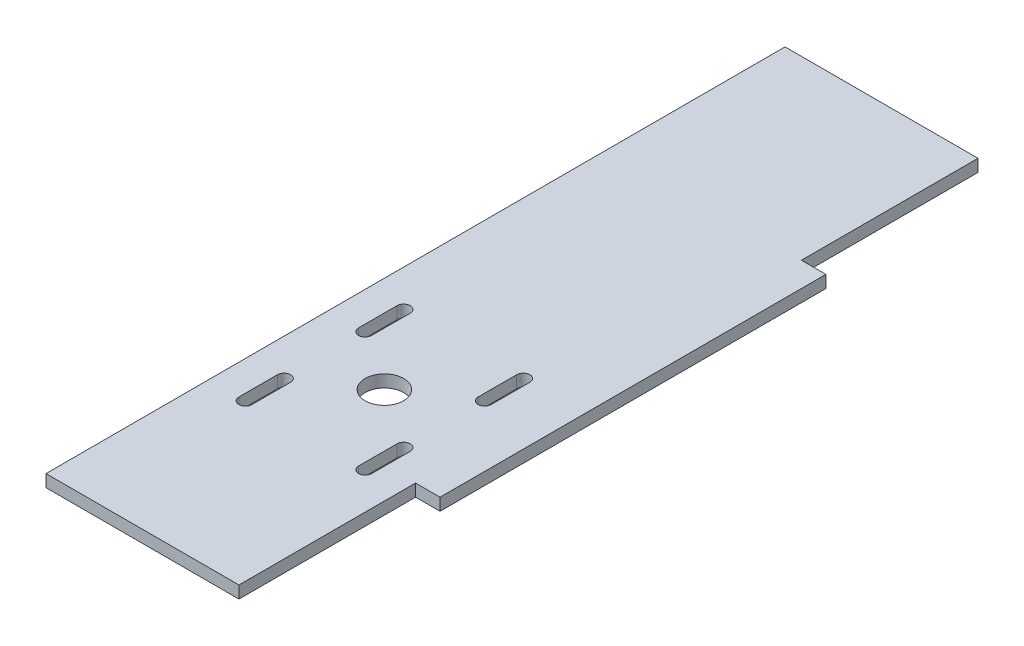
ISO-10303-21;
HEADER;
FILE_DESCRIPTION(('STEP AP214'),'2;1');
FILE_NAME('part.step','',(''),(''),'','','');
FILE_SCHEMA(('AUTOMOTIVE_DESIGN { 1 0 10303 214 1 1 1 1 }'));
ENDSEC;
DATA;
#1=APPLICATION_CONTEXT('core data for automotive mechanical design processes');
#2=APPLICATION_PROTOCOL_DEFINITION('international standard','automotive_design',2000,#1);
#3=PRODUCT_CONTEXT('',#1,'mechanical');
#4=PRODUCT('Part','Part','',(#3));
#5=PRODUCT_RELATED_PRODUCT_CATEGORY('part','',(#4));
#6=PRODUCT_DEFINITION_FORMATION('','',#4);
#7=PRODUCT_DEFINITION_CONTEXT('part definition',#1,'design');
#8=PRODUCT_DEFINITION('design','',#6,#7);
#9=PRODUCT_DEFINITION_SHAPE('','',#8);
#10=(LENGTH_UNIT() NAMED_UNIT(*) SI_UNIT(.MILLI.,.METRE.));
#11=(NAMED_UNIT(*) PLANE_ANGLE_UNIT() SI_UNIT($,.RADIAN.));
#12=(NAMED_UNIT(*) SI_UNIT($,.STERADIAN.) SOLID_ANGLE_UNIT());
#13=UNCERTAINTY_MEASURE_WITH_UNIT(LENGTH_MEASURE(1.E-05),#10,'distance_accuracy_value','');
#14=(GEOMETRIC_REPRESENTATION_CONTEXT(3) GLOBAL_UNCERTAINTY_ASSIGNED_CONTEXT((#13)) GLOBAL_UNIT_ASSIGNED_CONTEXT((#10,
#11,#12)) REPRESENTATION_CONTEXT('',''));
#15=CARTESIAN_POINT('',(0.,0.,0.));
#16=DIRECTION('',(0.,0.,1.));
#17=DIRECTION('',(1.,0.,0.));
#18=AXIS2_PLACEMENT_3D('',#15,#16,#17);
#19=CARTESIAN_POINT('',(-25.,3.175,0.));
#20=DIRECTION('',(-1.,0.,0.));
#21=DIRECTION('',(0.,0.,1.));
#22=AXIS2_PLACEMENT_3D('',#19,#20,#21);
#23=PLANE('',#22);
#24=DIRECTION('',(0.,0.,-1.));
#25=VECTOR('',#24,1.);
#26=CARTESIAN_POINT('',(-25.,0.,0.));
#27=LINE('',#26,#25);
#28=CARTESIAN_POINT('',(-25.,0.,145.75));
#29=VERTEX_POINT('',#28);
#30=CARTESIAN_POINT('',(-25.,0.,-45.75));
#31=VERTEX_POINT('',#30);
#32=EDGE_CURVE('E328',#29,#31,#27,.T.);
#33=ORIENTED_EDGE('',*,*,#32,.F.);
#34=DIRECTION('',(0.,-1.,0.));
#35=VECTOR('',#34,1.);
#36=CARTESIAN_POINT('',(-25.,3.175,145.75));
#37=LINE('',#36,#35);
#38=CARTESIAN_POINT('',(-25.,3.175,145.75));
#39=VERTEX_POINT('',#38);
#40=EDGE_CURVE('E11',#39,#29,#37,.T.);
#41=ORIENTED_EDGE('',*,*,#40,.F.);
#42=DIRECTION('',(0.,0.,-1.));
#43=VECTOR('',#42,1.);
#44=CARTESIAN_POINT('',(-25.,3.175,0.));
#45=LINE('',#44,#43);
#46=CARTESIAN_POINT('',(-25.,3.175,-45.75));
#47=VERTEX_POINT('',#46);
#48=EDGE_CURVE('E331',#39,#47,#45,.T.);
#49=ORIENTED_EDGE('',*,*,#48,.T.);
#50=DIRECTION('',(0.,-1.,0.));
#51=VECTOR('',#50,1.);
#52=CARTESIAN_POINT('',(-25.,3.175,-45.75));
#53=LINE('',#52,#51);
#54=EDGE_CURVE('E356',#47,#31,#53,.T.);
#55=ORIENTED_EDGE('',*,*,#54,.T.);
#56=EDGE_LOOP('',(#33,#41,#49,#55));
#57=FACE_BOUND('',#56,.T.);
#58=ADVANCED_FACE('F34',(#57),#23,.T.);
#59=CARTESIAN_POINT('',(0.,3.175,145.75));
#60=DIRECTION('',(0.,0.,1.));
#61=DIRECTION('',(1.,0.,0.));
#62=AXIS2_PLACEMENT_3D('',#59,#60,#61);
#63=PLANE('',#62);
#64=DIRECTION('',(-1.,0.,0.));
#65=VECTOR('',#64,1.);
#66=CARTESIAN_POINT('',(0.,0.,145.75));
#67=LINE('',#66,#65);
#68=CARTESIAN_POINT('',(25.,0.,145.75));
#69=VERTEX_POINT('',#68);
#70=EDGE_CURVE('E359',#69,#29,#67,.T.);
#71=ORIENTED_EDGE('',*,*,#70,.F.);
#72=DIRECTION('',(0.,-1.,0.));
#73=VECTOR('',#72,1.);
#74=CARTESIAN_POINT('',(25.,3.175,145.75));
#75=LINE('',#74,#73);
#76=CARTESIAN_POINT('',(25.,3.175,145.75));
#77=VERTEX_POINT('',#76);
#78=EDGE_CURVE('E41',#77,#69,#75,.T.);
#79=ORIENTED_EDGE('',*,*,#78,.F.);
#80=DIRECTION('',(-1.,0.,0.));
#81=VECTOR('',#80,1.);
#82=CARTESIAN_POINT('',(0.,3.175,145.75));
#83=LINE('',#82,#81);
#84=EDGE_CURVE('E334',#77,#39,#83,.T.);
#85=ORIENTED_EDGE('',*,*,#84,.T.);
#86=ORIENTED_EDGE('',*,*,#40,.T.);
#87=EDGE_LOOP('',(#71,#79,#85,#86));
#88=FACE_BOUND('',#87,.T.);
#89=ADVANCED_FACE('F396',(#88),#63,.T.);
#90=CARTESIAN_POINT('',(25.,3.175,0.));
#91=DIRECTION('',(1.,0.,0.));
#92=DIRECTION('',(0.,0.,-1.));
#93=AXIS2_PLACEMENT_3D('',#90,#91,#92);
#94=PLANE('',#93);
#95=DIRECTION('',(0.,0.,1.));
#96=VECTOR('',#95,1.);
#97=CARTESIAN_POINT('',(25.,0.,0.));
#98=LINE('',#97,#96);
#99=CARTESIAN_POINT('',(25.,0.,100.));
#100=VERTEX_POINT('',#99);
#101=EDGE_CURVE('E362',#100,#69,#98,.T.);
#102=ORIENTED_EDGE('',*,*,#101,.F.);
#103=DIRECTION('',(0.,-1.,0.));
#104=VECTOR('',#103,1.);
#105=CARTESIAN_POINT('',(25.,3.175,100.));
#106=LINE('',#105,#104);
#107=CARTESIAN_POINT('',(25.,3.175,100.));
#108=VERTEX_POINT('',#107);
#109=EDGE_CURVE('E388',#108,#100,#106,.T.);
#110=ORIENTED_EDGE('',*,*,#109,.F.);
#111=DIRECTION('',(0.,0.,1.));
#112=VECTOR('',#111,1.);
#113=CARTESIAN_POINT('',(25.,3.175,0.));
#114=LINE('',#113,#112);
#115=EDGE_CURVE('E338',#108,#77,#114,.T.);
#116=ORIENTED_EDGE('',*,*,#115,.T.);
#117=ORIENTED_EDGE('',*,*,#78,.T.);
#118=EDGE_LOOP('',(#102,#110,#116,#117));
#119=FACE_BOUND('',#118,.T.);
#120=ADVANCED_FACE('F392',(#119),#94,.T.);
#121=CARTESIAN_POINT('',(0.,3.175,100.));
#122=DIRECTION('',(0.,0.,1.));
#123=DIRECTION('',(1.,0.,0.));
#124=AXIS2_PLACEMENT_3D('',#121,#122,#123);
#125=PLANE('',#124);
#126=DIRECTION('',(-1.,0.,0.));
#127=VECTOR('',#126,1.);
#128=CARTESIAN_POINT('',(0.,0.,100.));
#129=LINE('',#128,#127);
#130=CARTESIAN_POINT('',(31.35,0.,100.));
#131=VERTEX_POINT('',#130);
#132=EDGE_CURVE('E365',#131,#100,#129,.T.);
#133=ORIENTED_EDGE('',*,*,#132,.F.);
#134=DIRECTION('',(0.,-1.,0.));
#135=VECTOR('',#134,1.);
#136=CARTESIAN_POINT('',(31.35,3.175,100.));
#137=LINE('',#136,#135);
#138=CARTESIAN_POINT('',(31.35,3.175,100.));
#139=VERTEX_POINT('',#138);
#140=EDGE_CURVE('E386',#139,#131,#137,.T.);
#141=ORIENTED_EDGE('',*,*,#140,.F.);
#142=DIRECTION('',(-1.,0.,0.));
#143=VECTOR('',#142,1.);
#144=CARTESIAN_POINT('',(0.,3.175,100.));
#145=LINE('',#144,#143);
#146=EDGE_CURVE('E341',#139,#108,#145,.T.);
#147=ORIENTED_EDGE('',*,*,#146,.T.);
#148=ORIENTED_EDGE('',*,*,#109,.T.);
#149=EDGE_LOOP('',(#133,#141,#147,#148));
#150=FACE_BOUND('',#149,.T.);
#151=ADVANCED_FACE('F403',(#150),#125,.T.);
#152=CARTESIAN_POINT('',(31.35,3.175,0.));
#153=DIRECTION('',(1.,0.,0.));
#154=DIRECTION('',(0.,0.,-1.));
#155=AXIS2_PLACEMENT_3D('',#152,#153,#154);
#156=PLANE('',#155);
#157=DIRECTION('',(0.,0.,1.));
#158=VECTOR('',#157,1.);
#159=CARTESIAN_POINT('',(31.35,0.,0.));
#160=LINE('',#159,#158);
#161=CARTESIAN_POINT('',(31.35,0.,0.));
#162=VERTEX_POINT('',#161);
#163=EDGE_CURVE('E368',#162,#131,#160,.T.);
#164=ORIENTED_EDGE('',*,*,#163,.F.);
#165=DIRECTION('',(0.,-1.,0.));
#166=VECTOR('',#165,1.);
#167=CARTESIAN_POINT('',(31.35,3.175,0.));
#168=LINE('',#167,#166);
#169=CARTESIAN_POINT('',(31.35,3.175,0.));
#170=VERTEX_POINT('',#169);
#171=EDGE_CURVE('E384',#170,#162,#168,.T.);
#172=ORIENTED_EDGE('',*,*,#171,.F.);
#173=DIRECTION('',(0.,0.,1.));
#174=VECTOR('',#173,1.);
#175=CARTESIAN_POINT('',(31.35,3.175,0.));
#176=LINE('',#175,#174);
#177=EDGE_CURVE('E344',#170,#139,#176,.T.);
#178=ORIENTED_EDGE('',*,*,#177,.T.);
#179=ORIENTED_EDGE('',*,*,#140,.T.);
#180=EDGE_LOOP('',(#164,#172,#178,#179));
#181=FACE_BOUND('',#180,.T.);
#182=ADVANCED_FACE('F422',(#181),#156,.T.);
#183=CARTESIAN_POINT('',(0.,3.175,0.));
#184=DIRECTION('',(0.,0.,-1.));
#185=DIRECTION('',(-1.,0.,0.));
#186=AXIS2_PLACEMENT_3D('',#183,#184,#185);
#187=PLANE('',#186);
#188=DIRECTION('',(1.,0.,0.));
#189=VECTOR('',#188,1.);
#190=CARTESIAN_POINT('',(0.,0.,0.));
#191=LINE('',#190,#189);
#192=CARTESIAN_POINT('',(25.,0.,0.));
#193=VERTEX_POINT('',#192);
#194=EDGE_CURVE('E371',#193,#162,#191,.T.);
#195=ORIENTED_EDGE('',*,*,#194,.F.);
#196=DIRECTION('',(0.,-1.,0.));
#197=VECTOR('',#196,1.);
#198=CARTESIAN_POINT('',(25.,3.175,0.));
#199=LINE('',#198,#197);
#200=CARTESIAN_POINT('',(25.,3.175,0.));
#201=VERTEX_POINT('',#200);
#202=EDGE_CURVE('E382',#201,#193,#199,.T.);
#203=ORIENTED_EDGE('',*,*,#202,.F.);
#204=DIRECTION('',(1.,0.,0.));
#205=VECTOR('',#204,1.);
#206=CARTESIAN_POINT('',(0.,3.175,0.));
#207=LINE('',#206,#205);
#208=EDGE_CURVE('E347',#201,#170,#207,.T.);
#209=ORIENTED_EDGE('',*,*,#208,.T.);
#210=ORIENTED_EDGE('',*,*,#171,.T.);
#211=EDGE_LOOP('',(#195,#203,#209,#210));
#212=FACE_BOUND('',#211,.T.);
#213=ADVANCED_FACE('F419',(#212),#187,.T.);
#214=CARTESIAN_POINT('',(25.,3.175,0.));
#215=DIRECTION('',(1.,0.,0.));
#216=DIRECTION('',(0.,0.,-1.));
#217=AXIS2_PLACEMENT_3D('',#214,#215,#216);
#218=PLANE('',#217);
#219=DIRECTION('',(0.,0.,1.));
#220=VECTOR('',#219,1.);
#221=CARTESIAN_POINT('',(25.,0.,0.));
#222=LINE('',#221,#220);
#223=CARTESIAN_POINT('',(25.,0.,-45.75));
#224=VERTEX_POINT('',#223);
#225=EDGE_CURVE('E374',#224,#193,#222,.T.);
#226=ORIENTED_EDGE('',*,*,#225,.F.);
#227=DIRECTION('',(0.,-1.,0.));
#228=VECTOR('',#227,1.);
#229=CARTESIAN_POINT('',(25.,3.175,-45.75));
#230=LINE('',#229,#228);
#231=CARTESIAN_POINT('',(25.,3.175,-45.75));
#232=VERTEX_POINT('',#231);
#233=EDGE_CURVE('E380',#232,#224,#230,.T.);
#234=ORIENTED_EDGE('',*,*,#233,.F.);
#235=DIRECTION('',(0.,0.,1.));
#236=VECTOR('',#235,1.);
#237=CARTESIAN_POINT('',(25.,3.175,0.));
#238=LINE('',#237,#236);
#239=EDGE_CURVE('E350',#232,#201,#238,.T.);
#240=ORIENTED_EDGE('',*,*,#239,.T.);
#241=ORIENTED_EDGE('',*,*,#202,.T.);
#242=EDGE_LOOP('',(#226,#234,#240,#241));
#243=FACE_BOUND('',#242,.T.);
#244=ADVANCED_FACE('F416',(#243),#218,.T.);
#245=CARTESIAN_POINT('',(0.,3.175,-45.75));
#246=DIRECTION('',(0.,0.,-1.));
#247=DIRECTION('',(-1.,0.,0.));
#248=AXIS2_PLACEMENT_3D('',#245,#246,#247);
#249=PLANE('',#248);
#250=DIRECTION('',(1.,0.,0.));
#251=VECTOR('',#250,1.);
#252=CARTESIAN_POINT('',(0.,0.,-45.75));
#253=LINE('',#252,#251);
#254=EDGE_CURVE('E335',#31,#224,#253,.T.);
#255=ORIENTED_EDGE('',*,*,#254,.F.);
#256=ORIENTED_EDGE('',*,*,#54,.F.);
#257=DIRECTION('',(1.,0.,0.));
#258=VECTOR('',#257,1.);
#259=CARTESIAN_POINT('',(0.,3.175,-45.75));
#260=LINE('',#259,#258);
#261=EDGE_CURVE('E353',#47,#232,#260,.T.);
#262=ORIENTED_EDGE('',*,*,#261,.T.);
#263=ORIENTED_EDGE('',*,*,#233,.T.);
#264=EDGE_LOOP('',(#255,#256,#262,#263));
#265=FACE_BOUND('',#264,.T.);
#266=ADVANCED_FACE('F413',(#265),#249,.T.);
#267=CARTESIAN_POINT('',(0.,3.175,0.));
#268=DIRECTION('',(0.,1.,0.));
#269=DIRECTION('',(0.,0.,1.));
#270=AXIS2_PLACEMENT_3D('',#267,#268,#269);
#271=PLANE('',#270);
#272=CARTESIAN_POINT('',(-15.5,3.175,62.575));
#273=DIRECTION('',(0.,-1.,0.));
#274=DIRECTION('',(0.,0.,1.));
#275=AXIS2_PLACEMENT_3D('',#272,#273,#274);
#276=CIRCLE('',#275,1.69999999999998);
#277=CARTESIAN_POINT('',(-17.2,3.175,62.575));
#278=VERTEX_POINT('',#277);
#279=CARTESIAN_POINT('',(-13.8,3.175,62.575));
#280=VERTEX_POINT('',#279);
#281=EDGE_CURVE('E197',#278,#280,#276,.T.);
#282=ORIENTED_EDGE('',*,*,#281,.T.);
#283=DIRECTION('',(0.,0.,1.));
#284=VECTOR('',#283,1.);
#285=CARTESIAN_POINT('',(-13.8,3.175,62.575));
#286=LINE('',#285,#284);
#287=CARTESIAN_POINT('',(-13.8,3.175,72.5750000000001));
#288=VERTEX_POINT('',#287);
#289=EDGE_CURVE('E204',#280,#288,#286,.T.);
#290=ORIENTED_EDGE('',*,*,#289,.T.);
#291=CARTESIAN_POINT('',(-15.5,3.175,72.575));
#292=DIRECTION('',(0.,-1.,0.));
#293=DIRECTION('',(0.,0.,1.));
#294=AXIS2_PLACEMENT_3D('',#291,#292,#293);
#295=CIRCLE('',#294,1.69999999999998);
#296=CARTESIAN_POINT('',(-17.2,3.175,72.575));
#297=VERTEX_POINT('',#296);
#298=EDGE_CURVE('E210',#288,#297,#295,.T.);
#299=ORIENTED_EDGE('',*,*,#298,.T.);
#300=DIRECTION('',(0.,0.,-1.));
#301=VECTOR('',#300,1.);
#302=CARTESIAN_POINT('',(-17.2,3.175,62.575));
#303=LINE('',#302,#301);
#304=EDGE_CURVE('E201',#297,#278,#303,.T.);
#305=ORIENTED_EDGE('',*,*,#304,.T.);
#306=EDGE_LOOP('',(#282,#290,#299,#305));
#307=FACE_BOUND('',#306,.T.);
#308=CARTESIAN_POINT('',(15.5,3.175,62.575));
#309=DIRECTION('',(0.,-1.,0.));
#310=DIRECTION('',(0.,0.,1.));
#311=AXIS2_PLACEMENT_3D('',#308,#309,#310);
#312=CIRCLE('',#311,1.69999999999999);
#313=CARTESIAN_POINT('',(13.8,3.175,62.575));
#314=VERTEX_POINT('',#313);
#315=CARTESIAN_POINT('',(17.2,3.175,62.575));
#316=VERTEX_POINT('',#315);
#317=EDGE_CURVE('E234',#314,#316,#312,.T.);
#318=ORIENTED_EDGE('',*,*,#317,.T.);
#319=DIRECTION('',(0.,0.,1.));
#320=VECTOR('',#319,1.);
#321=CARTESIAN_POINT('',(17.2,3.175,62.575));
#322=LINE('',#321,#320);
#323=CARTESIAN_POINT('',(17.2,3.175,72.575));
#324=VERTEX_POINT('',#323);
#325=EDGE_CURVE('E237',#316,#324,#322,.T.);
#326=ORIENTED_EDGE('',*,*,#325,.T.);
#327=CARTESIAN_POINT('',(15.5,3.175,72.575));
#328=DIRECTION('',(0.,-1.,0.));
#329=DIRECTION('',(0.,0.,1.));
#330=AXIS2_PLACEMENT_3D('',#327,#328,#329);
#331=CIRCLE('',#330,1.7);
#332=CARTESIAN_POINT('',(13.8,3.175,72.575));
#333=VERTEX_POINT('',#332);
#334=EDGE_CURVE('E240',#324,#333,#331,.T.);
#335=ORIENTED_EDGE('',*,*,#334,.T.);
#336=DIRECTION('',(0.,0.,-1.));
#337=VECTOR('',#336,1.);
#338=CARTESIAN_POINT('',(13.8,3.175,62.575));
#339=LINE('',#338,#337);
#340=EDGE_CURVE('E243',#333,#314,#339,.T.);
#341=ORIENTED_EDGE('',*,*,#340,.T.);
#342=EDGE_LOOP('',(#318,#326,#335,#341));
#343=FACE_BOUND('',#342,.T.);
#344=CARTESIAN_POINT('',(-15.5,3.175,103.575));
#345=DIRECTION('',(0.,-1.,0.));
#346=DIRECTION('',(0.,0.,-1.));
#347=AXIS2_PLACEMENT_3D('',#344,#345,#346);
#348=CIRCLE('',#347,1.69999999999998);
#349=CARTESIAN_POINT('',(-13.8,3.175,103.575));
#350=VERTEX_POINT('',#349);
#351=CARTESIAN_POINT('',(-17.2,3.175,103.575));
#352=VERTEX_POINT('',#351);
#353=EDGE_CURVE('E263',#350,#352,#348,.T.);
#354=ORIENTED_EDGE('',*,*,#353,.T.);
#355=DIRECTION('',(0.,0.,-1.));
#356=VECTOR('',#355,1.);
#357=CARTESIAN_POINT('',(-17.2,3.175,103.575));
#358=LINE('',#357,#356);
#359=CARTESIAN_POINT('',(-17.2,3.175,93.575));
#360=VERTEX_POINT('',#359);
#361=EDGE_CURVE('E266',#352,#360,#358,.T.);
#362=ORIENTED_EDGE('',*,*,#361,.T.);
#363=CARTESIAN_POINT('',(-15.5,3.175,93.575));
#364=DIRECTION('',(0.,-1.,0.));
#365=DIRECTION('',(0.,0.,-1.));
#366=AXIS2_PLACEMENT_3D('',#363,#364,#365);
#367=CIRCLE('',#366,1.69999999999998);
#368=CARTESIAN_POINT('',(-13.8,3.175,93.575));
#369=VERTEX_POINT('',#368);
#370=EDGE_CURVE('E269',#360,#369,#367,.T.);
#371=ORIENTED_EDGE('',*,*,#370,.T.);
#372=DIRECTION('',(0.,0.,1.));
#373=VECTOR('',#372,1.);
#374=CARTESIAN_POINT('',(-13.8,3.175,103.575));
#375=LINE('',#374,#373);
#376=EDGE_CURVE('E272',#369,#350,#375,.T.);
#377=ORIENTED_EDGE('',*,*,#376,.T.);
#378=EDGE_LOOP('',(#354,#362,#371,#377));
#379=FACE_BOUND('',#378,.T.);
#380=CARTESIAN_POINT('',(15.5,3.175,103.575));
#381=DIRECTION('',(0.,-1.,0.));
#382=DIRECTION('',(0.,0.,-1.));
#383=AXIS2_PLACEMENT_3D('',#380,#381,#382);
#384=CIRCLE('',#383,1.69999999999999);
#385=CARTESIAN_POINT('',(17.2,3.175,103.575));
#386=VERTEX_POINT('',#385);
#387=CARTESIAN_POINT('',(13.8,3.175,103.575));
#388=VERTEX_POINT('',#387);
#389=EDGE_CURVE('E294',#386,#388,#384,.T.);
#390=ORIENTED_EDGE('',*,*,#389,.T.);
#391=DIRECTION('',(0.,0.,-1.));
#392=VECTOR('',#391,1.);
#393=CARTESIAN_POINT('',(13.8,3.175,103.575));
#394=LINE('',#393,#392);
#395=CARTESIAN_POINT('',(13.8,3.175,93.575));
#396=VERTEX_POINT('',#395);
#397=EDGE_CURVE('E297',#388,#396,#394,.T.);
#398=ORIENTED_EDGE('',*,*,#397,.T.);
#399=CARTESIAN_POINT('',(15.5,3.175,93.575));
#400=DIRECTION('',(0.,-1.,0.));
#401=DIRECTION('',(0.,0.,-1.));
#402=AXIS2_PLACEMENT_3D('',#399,#400,#401);
#403=CIRCLE('',#402,1.69999999999999);
#404=CARTESIAN_POINT('',(17.2,3.175,93.575));
#405=VERTEX_POINT('',#404);
#406=EDGE_CURVE('E300',#396,#405,#403,.T.);
#407=ORIENTED_EDGE('',*,*,#406,.T.);
#408=DIRECTION('',(0.,0.,1.));
#409=VECTOR('',#408,1.);
#410=CARTESIAN_POINT('',(17.2,3.175,103.575));
#411=LINE('',#410,#409);
#412=EDGE_CURVE('E303',#405,#386,#411,.T.);
#413=ORIENTED_EDGE('',*,*,#412,.T.);
#414=EDGE_LOOP('',(#390,#398,#407,#413));
#415=FACE_BOUND('',#414,.T.);
#416=CARTESIAN_POINT('',(0.,3.175,83.075));
#417=DIRECTION('',(0.,1.,0.));
#418=DIRECTION('',(0.,0.,1.));
#419=AXIS2_PLACEMENT_3D('',#416,#417,#418);
#420=CIRCLE('',#419,5.00000000000001);
#421=CARTESIAN_POINT('',(0.,3.175,88.075));
#422=VERTEX_POINT('',#421);
#423=EDGE_CURVE('E316',#422,#422,#420,.T.);
#424=ORIENTED_EDGE('',*,*,#423,.F.);
#425=EDGE_LOOP('',(#424));
#426=FACE_BOUND('',#425,.T.);
#427=ORIENTED_EDGE('',*,*,#48,.F.);
#428=ORIENTED_EDGE('',*,*,#84,.F.);
#429=ORIENTED_EDGE('',*,*,#115,.F.);
#430=ORIENTED_EDGE('',*,*,#146,.F.);
#431=ORIENTED_EDGE('',*,*,#177,.F.);
#432=ORIENTED_EDGE('',*,*,#208,.F.);
#433=ORIENTED_EDGE('',*,*,#239,.F.);
#434=ORIENTED_EDGE('',*,*,#261,.F.);
#435=EDGE_LOOP('',(#427,#428,#429,#430,#431,#432,#433,#434));
#436=FACE_BOUND('',#435,.T.);
#437=ADVANCED_FACE('F212',(#307,#343,#379,#415,#426,#436),#271,.T.);
#438=CARTESIAN_POINT('',(0.,0.,0.));
#439=DIRECTION('',(0.,1.,0.));
#440=DIRECTION('',(0.,0.,1.));
#441=AXIS2_PLACEMENT_3D('',#438,#439,#440);
#442=PLANE('',#441);
#443=DIRECTION('',(0.,0.,-1.));
#444=VECTOR('',#443,1.);
#445=CARTESIAN_POINT('',(13.8,0.,103.575));
#446=LINE('',#445,#444);
#447=CARTESIAN_POINT('',(13.8,0.,103.575));
#448=VERTEX_POINT('',#447);
#449=CARTESIAN_POINT('',(13.8,0.,93.575));
#450=VERTEX_POINT('',#449);
#451=EDGE_CURVE('E307',#448,#450,#446,.T.);
#452=ORIENTED_EDGE('',*,*,#451,.F.);
#453=CARTESIAN_POINT('',(15.5,0.,103.575));
#454=DIRECTION('',(0.,-1.,0.));
#455=DIRECTION('',(0.,0.,-1.));
#456=AXIS2_PLACEMENT_3D('',#453,#454,#455);
#457=CIRCLE('',#456,1.69999999999999);
#458=CARTESIAN_POINT('',(17.2,0.,103.575));
#459=VERTEX_POINT('',#458);
#460=EDGE_CURVE('E285',#459,#448,#457,.T.);
#461=ORIENTED_EDGE('',*,*,#460,.F.);
#462=DIRECTION('',(0.,0.,1.));
#463=VECTOR('',#462,1.);
#464=CARTESIAN_POINT('',(17.2,0.,103.575));
#465=LINE('',#464,#463);
#466=CARTESIAN_POINT('',(17.2,0.,93.575));
#467=VERTEX_POINT('',#466);
#468=EDGE_CURVE('E298',#467,#459,#465,.T.);
#469=ORIENTED_EDGE('',*,*,#468,.F.);
#470=CARTESIAN_POINT('',(15.5,0.,93.575));
#471=DIRECTION('',(0.,-1.,0.));
#472=DIRECTION('',(0.,0.,-1.));
#473=AXIS2_PLACEMENT_3D('',#470,#471,#472);
#474=CIRCLE('',#473,1.69999999999999);
#475=EDGE_CURVE('E309',#450,#467,#474,.T.);
#476=ORIENTED_EDGE('',*,*,#475,.F.);
#477=EDGE_LOOP('',(#452,#461,#469,#476));
#478=FACE_BOUND('',#477,.T.);
#479=DIRECTION('',(0.,0.,-1.));
#480=VECTOR('',#479,1.);
#481=CARTESIAN_POINT('',(-17.2,0.,103.575));
#482=LINE('',#481,#480);
#483=CARTESIAN_POINT('',(-17.2,0.,103.575));
#484=VERTEX_POINT('',#483);
#485=CARTESIAN_POINT('',(-17.2,0.,93.575));
#486=VERTEX_POINT('',#485);
#487=EDGE_CURVE('E276',#484,#486,#482,.T.);
#488=ORIENTED_EDGE('',*,*,#487,.F.);
#489=CARTESIAN_POINT('',(-15.5,0.,103.575));
#490=DIRECTION('',(0.,-1.,0.));
#491=DIRECTION('',(0.,0.,-1.));
#492=AXIS2_PLACEMENT_3D('',#489,#490,#491);
#493=CIRCLE('',#492,1.69999999999998);
#494=CARTESIAN_POINT('',(-13.8,0.,103.575));
#495=VERTEX_POINT('',#494);
#496=EDGE_CURVE('E255',#495,#484,#493,.T.);
#497=ORIENTED_EDGE('',*,*,#496,.F.);
#498=DIRECTION('',(0.,0.,1.));
#499=VECTOR('',#498,1.);
#500=CARTESIAN_POINT('',(-13.8,0.,103.575));
#501=LINE('',#500,#499);
#502=CARTESIAN_POINT('',(-13.8,0.,93.575));
#503=VERTEX_POINT('',#502);
#504=EDGE_CURVE('E267',#503,#495,#501,.T.);
#505=ORIENTED_EDGE('',*,*,#504,.F.);
#506=CARTESIAN_POINT('',(-15.5,0.,93.575));
#507=DIRECTION('',(0.,-1.,0.));
#508=DIRECTION('',(0.,0.,-1.));
#509=AXIS2_PLACEMENT_3D('',#506,#507,#508);
#510=CIRCLE('',#509,1.69999999999998);
#511=EDGE_CURVE('E278',#486,#503,#510,.T.);
#512=ORIENTED_EDGE('',*,*,#511,.F.);
#513=EDGE_LOOP('',(#488,#497,#505,#512));
#514=FACE_BOUND('',#513,.T.);
#515=DIRECTION('',(0.,0.,1.));
#516=VECTOR('',#515,1.);
#517=CARTESIAN_POINT('',(-13.8,0.,62.575));
#518=LINE('',#517,#516);
#519=CARTESIAN_POINT('',(-13.8,0.,62.575));
#520=VERTEX_POINT('',#519);
#521=CARTESIAN_POINT('',(-13.8,0.,72.5750000000001));
#522=VERTEX_POINT('',#521);
#523=EDGE_CURVE('E224',#520,#522,#518,.T.);
#524=ORIENTED_EDGE('',*,*,#523,.F.);
#525=CARTESIAN_POINT('',(-15.5,0.,62.575));
#526=DIRECTION('',(0.,-1.,0.));
#527=DIRECTION('',(0.,0.,1.));
#528=AXIS2_PLACEMENT_3D('',#525,#526,#527);
#529=CIRCLE('',#528,1.69999999999998);
#530=CARTESIAN_POINT('',(-17.2,0.,62.575));
#531=VERTEX_POINT('',#530);
#532=EDGE_CURVE('E48',#531,#520,#529,.T.);
#533=ORIENTED_EDGE('',*,*,#532,.F.);
#534=DIRECTION('',(0.,0.,-1.));
#535=VECTOR('',#534,1.);
#536=CARTESIAN_POINT('',(-17.2,0.,62.575));
#537=LINE('',#536,#535);
#538=CARTESIAN_POINT('',(-17.2,0.,72.575));
#539=VERTEX_POINT('',#538);
#540=EDGE_CURVE('E216',#539,#531,#537,.T.);
#541=ORIENTED_EDGE('',*,*,#540,.F.);
#542=CARTESIAN_POINT('',(-15.5,0.,72.575));
#543=DIRECTION('',(0.,-1.,0.));
#544=DIRECTION('',(0.,0.,1.));
#545=AXIS2_PLACEMENT_3D('',#542,#543,#544);
#546=CIRCLE('',#545,1.69999999999998);
#547=EDGE_CURVE('E218',#522,#539,#546,.T.);
#548=ORIENTED_EDGE('',*,*,#547,.F.);
#549=EDGE_LOOP('',(#524,#533,#541,#548));
#550=FACE_BOUND('',#549,.T.);
#551=DIRECTION('',(0.,0.,1.));
#552=VECTOR('',#551,1.);
#553=CARTESIAN_POINT('',(17.2,0.,62.575));
#554=LINE('',#553,#552);
#555=CARTESIAN_POINT('',(17.2,0.,62.575));
#556=VERTEX_POINT('',#555);
#557=CARTESIAN_POINT('',(17.2,0.,72.575));
#558=VERTEX_POINT('',#557);
#559=EDGE_CURVE('E247',#556,#558,#554,.T.);
#560=ORIENTED_EDGE('',*,*,#559,.F.);
#561=CARTESIAN_POINT('',(15.5,0.,62.575));
#562=DIRECTION('',(0.,-1.,0.));
#563=DIRECTION('',(0.,0.,1.));
#564=AXIS2_PLACEMENT_3D('',#561,#562,#563);
#565=CIRCLE('',#564,1.69999999999999);
#566=CARTESIAN_POINT('',(13.8,0.,62.575));
#567=VERTEX_POINT('',#566);
#568=EDGE_CURVE('E56',#567,#556,#565,.T.);
#569=ORIENTED_EDGE('',*,*,#568,.F.);
#570=DIRECTION('',(0.,0.,-1.));
#571=VECTOR('',#570,1.);
#572=CARTESIAN_POINT('',(13.8,0.,62.575));
#573=LINE('',#572,#571);
#574=CARTESIAN_POINT('',(13.8,0.,72.575));
#575=VERTEX_POINT('',#574);
#576=EDGE_CURVE('E238',#575,#567,#573,.T.);
#577=ORIENTED_EDGE('',*,*,#576,.F.);
#578=CARTESIAN_POINT('',(15.5,0.,72.575));
#579=DIRECTION('',(0.,-1.,0.));
#580=DIRECTION('',(0.,0.,1.));
#581=AXIS2_PLACEMENT_3D('',#578,#579,#580);
#582=CIRCLE('',#581,1.7);
#583=EDGE_CURVE('E249',#558,#575,#582,.T.);
#584=ORIENTED_EDGE('',*,*,#583,.F.);
#585=EDGE_LOOP('',(#560,#569,#577,#584));
#586=FACE_BOUND('',#585,.T.);
#587=CARTESIAN_POINT('',(0.,0.,83.075));
#588=DIRECTION('',(0.,1.,0.));
#589=DIRECTION('',(0.,0.,1.));
#590=AXIS2_PLACEMENT_3D('',#587,#588,#589);
#591=CIRCLE('',#590,5.00000000000001);
#592=CARTESIAN_POINT('',(0.,0.,88.075));
#593=VERTEX_POINT('',#592);
#594=EDGE_CURVE('E325',#593,#593,#591,.T.);
#595=ORIENTED_EDGE('',*,*,#594,.T.);
#596=EDGE_LOOP('',(#595));
#597=FACE_BOUND('',#596,.T.);
#598=ORIENTED_EDGE('',*,*,#32,.T.);
#599=ORIENTED_EDGE('',*,*,#254,.T.);
#600=ORIENTED_EDGE('',*,*,#225,.T.);
#601=ORIENTED_EDGE('',*,*,#194,.T.);
#602=ORIENTED_EDGE('',*,*,#163,.T.);
#603=ORIENTED_EDGE('',*,*,#132,.T.);
#604=ORIENTED_EDGE('',*,*,#101,.T.);
#605=ORIENTED_EDGE('',*,*,#70,.T.);
#606=EDGE_LOOP('',(#598,#599,#600,#601,#602,#603,#604,#605));
#607=FACE_BOUND('',#606,.T.);
#608=ADVANCED_FACE('F399',(#478,#514,#550,#586,#597,#607),#442,.F.);
#609=CARTESIAN_POINT('',(0.,0.,83.075));
#610=DIRECTION('',(0.,1.,0.));
#611=DIRECTION('',(0.,0.,1.));
#612=AXIS2_PLACEMENT_3D('',#609,#610,#611);
#613=CYLINDRICAL_SURFACE('',#612,5.00000000000001);
#614=ORIENTED_EDGE('',*,*,#594,.F.);
#615=EDGE_LOOP('',(#614));
#616=FACE_BOUND('',#615,.T.);
#617=ORIENTED_EDGE('',*,*,#423,.T.);
#618=EDGE_LOOP('',(#617));
#619=FACE_BOUND('',#618,.T.);
#620=ADVANCED_FACE('F478',(#616,#619),#613,.F.);
#621=CARTESIAN_POINT('',(17.2,3.175,103.575));
#622=DIRECTION('',(1.,0.,0.));
#623=DIRECTION('',(0.,0.,-1.));
#624=AXIS2_PLACEMENT_3D('',#621,#622,#623);
#625=PLANE('',#624);
#626=ORIENTED_EDGE('',*,*,#412,.F.);
#627=DIRECTION('',(0.,-1.,0.));
#628=VECTOR('',#627,1.);
#629=CARTESIAN_POINT('',(17.2,3.175,93.575));
#630=LINE('',#629,#628);
#631=EDGE_CURVE('E317',#405,#467,#630,.T.);
#632=ORIENTED_EDGE('',*,*,#631,.T.);
#633=ORIENTED_EDGE('',*,*,#468,.T.);
#634=DIRECTION('',(0.,-1.,0.));
#635=VECTOR('',#634,1.);
#636=CARTESIAN_POINT('',(17.2,3.175,103.575));
#637=LINE('',#636,#635);
#638=EDGE_CURVE('E313',#386,#459,#637,.T.);
#639=ORIENTED_EDGE('',*,*,#638,.F.);
#640=EDGE_LOOP('',(#626,#632,#633,#639));
#641=FACE_BOUND('',#640,.T.);
#642=ADVANCED_FACE('F483',(#641),#625,.F.);
#643=CARTESIAN_POINT('',(13.8,3.175,103.575));
#644=DIRECTION('',(-1.,0.,0.));
#645=DIRECTION('',(0.,0.,1.));
#646=AXIS2_PLACEMENT_3D('',#643,#644,#645);
#647=PLANE('',#646);
#648=ORIENTED_EDGE('',*,*,#397,.F.);
#649=DIRECTION('',(0.,-1.,0.));
#650=VECTOR('',#649,1.);
#651=CARTESIAN_POINT('',(13.8,3.175,103.575));
#652=LINE('',#651,#650);
#653=EDGE_CURVE('E305',#388,#448,#652,.T.);
#654=ORIENTED_EDGE('',*,*,#653,.T.);
#655=ORIENTED_EDGE('',*,*,#451,.T.);
#656=DIRECTION('',(0.,-1.,0.));
#657=VECTOR('',#656,1.);
#658=CARTESIAN_POINT('',(13.8,3.175,93.575));
#659=LINE('',#658,#657);
#660=EDGE_CURVE('E320',#396,#450,#659,.T.);
#661=ORIENTED_EDGE('',*,*,#660,.F.);
#662=EDGE_LOOP('',(#648,#654,#655,#661));
#663=FACE_BOUND('',#662,.T.);
#664=ADVANCED_FACE('F508',(#663),#647,.F.);
#665=CARTESIAN_POINT('',(15.5,3.175,103.575));
#666=DIRECTION('',(0.,-1.,0.));
#667=DIRECTION('',(0.,0.,-1.));
#668=AXIS2_PLACEMENT_3D('',#665,#666,#667);
#669=CYLINDRICAL_SURFACE('',#668,1.69999999999999);
#670=ORIENTED_EDGE('',*,*,#460,.T.);
#671=ORIENTED_EDGE('',*,*,#653,.F.);
#672=ORIENTED_EDGE('',*,*,#389,.F.);
#673=ORIENTED_EDGE('',*,*,#638,.T.);
#674=EDGE_LOOP('',(#670,#671,#672,#673));
#675=FACE_BOUND('',#674,.T.);
#676=ADVANCED_FACE('F518',(#675),#669,.F.);
#677=CARTESIAN_POINT('',(15.5,3.175,93.575));
#678=DIRECTION('',(0.,-1.,0.));
#679=DIRECTION('',(0.,0.,-1.));
#680=AXIS2_PLACEMENT_3D('',#677,#678,#679);
#681=CYLINDRICAL_SURFACE('',#680,1.69999999999999);
#682=ORIENTED_EDGE('',*,*,#475,.T.);
#683=ORIENTED_EDGE('',*,*,#631,.F.);
#684=ORIENTED_EDGE('',*,*,#406,.F.);
#685=ORIENTED_EDGE('',*,*,#660,.T.);
#686=EDGE_LOOP('',(#682,#683,#684,#685));
#687=FACE_BOUND('',#686,.T.);
#688=ADVANCED_FACE('F528',(#687),#681,.F.);
#689=CARTESIAN_POINT('',(-13.8,3.175,103.575));
#690=DIRECTION('',(1.,0.,0.));
#691=DIRECTION('',(0.,0.,-1.));
#692=AXIS2_PLACEMENT_3D('',#689,#690,#691);
#693=PLANE('',#692);
#694=ORIENTED_EDGE('',*,*,#376,.F.);
#695=DIRECTION('',(0.,-1.,0.));
#696=VECTOR('',#695,1.);
#697=CARTESIAN_POINT('',(-13.8,3.175,93.575));
#698=LINE('',#697,#696);
#699=EDGE_CURVE('E286',#369,#503,#698,.T.);
#700=ORIENTED_EDGE('',*,*,#699,.T.);
#701=ORIENTED_EDGE('',*,*,#504,.T.);
#702=DIRECTION('',(0.,-1.,0.));
#703=VECTOR('',#702,1.);
#704=CARTESIAN_POINT('',(-13.8,3.175,103.575));
#705=LINE('',#704,#703);
#706=EDGE_CURVE('E282',#350,#495,#705,.T.);
#707=ORIENTED_EDGE('',*,*,#706,.F.);
#708=EDGE_LOOP('',(#694,#700,#701,#707));
#709=FACE_BOUND('',#708,.T.);
#710=ADVANCED_FACE('F538',(#709),#693,.F.);
#711=CARTESIAN_POINT('',(-17.2,3.175,103.575));
#712=DIRECTION('',(-1.,0.,0.));
#713=DIRECTION('',(0.,0.,1.));
#714=AXIS2_PLACEMENT_3D('',#711,#712,#713);
#715=PLANE('',#714);
#716=ORIENTED_EDGE('',*,*,#361,.F.);
#717=DIRECTION('',(0.,-1.,0.));
#718=VECTOR('',#717,1.);
#719=CARTESIAN_POINT('',(-17.2,3.175,103.575));
#720=LINE('',#719,#718);
#721=EDGE_CURVE('E274',#352,#484,#720,.T.);
#722=ORIENTED_EDGE('',*,*,#721,.T.);
#723=ORIENTED_EDGE('',*,*,#487,.T.);
#724=DIRECTION('',(0.,-1.,0.));
#725=VECTOR('',#724,1.);
#726=CARTESIAN_POINT('',(-17.2,3.175,93.575));
#727=LINE('',#726,#725);
#728=EDGE_CURVE('E289',#360,#486,#727,.T.);
#729=ORIENTED_EDGE('',*,*,#728,.F.);
#730=EDGE_LOOP('',(#716,#722,#723,#729));
#731=FACE_BOUND('',#730,.T.);
#732=ADVANCED_FACE('F548',(#731),#715,.F.);
#733=CARTESIAN_POINT('',(-15.5,3.175,103.575));
#734=DIRECTION('',(0.,-1.,0.));
#735=DIRECTION('',(0.,0.,-1.));
#736=AXIS2_PLACEMENT_3D('',#733,#734,#735);
#737=CYLINDRICAL_SURFACE('',#736,1.69999999999998);
#738=ORIENTED_EDGE('',*,*,#496,.T.);
#739=ORIENTED_EDGE('',*,*,#721,.F.);
#740=ORIENTED_EDGE('',*,*,#353,.F.);
#741=ORIENTED_EDGE('',*,*,#706,.T.);
#742=EDGE_LOOP('',(#738,#739,#740,#741));
#743=FACE_BOUND('',#742,.T.);
#744=ADVANCED_FACE('F558',(#743),#737,.F.);
#745=CARTESIAN_POINT('',(-15.5,3.175,93.575));
#746=DIRECTION('',(0.,-1.,0.));
#747=DIRECTION('',(0.,0.,-1.));
#748=AXIS2_PLACEMENT_3D('',#745,#746,#747);
#749=CYLINDRICAL_SURFACE('',#748,1.69999999999998);
#750=ORIENTED_EDGE('',*,*,#511,.T.);
#751=ORIENTED_EDGE('',*,*,#699,.F.);
#752=ORIENTED_EDGE('',*,*,#370,.F.);
#753=ORIENTED_EDGE('',*,*,#728,.T.);
#754=EDGE_LOOP('',(#750,#751,#752,#753));
#755=FACE_BOUND('',#754,.T.);
#756=ADVANCED_FACE('F568',(#755),#749,.F.);
#757=CARTESIAN_POINT('',(13.8,3.175,62.575));
#758=DIRECTION('',(-1.,0.,0.));
#759=DIRECTION('',(0.,0.,1.));
#760=AXIS2_PLACEMENT_3D('',#757,#758,#759);
#761=PLANE('',#760);
#762=ORIENTED_EDGE('',*,*,#340,.F.);
#763=DIRECTION('',(0.,-1.,0.));
#764=VECTOR('',#763,1.);
#765=CARTESIAN_POINT('',(13.8,3.175,72.575));
#766=LINE('',#765,#764);
#767=EDGE_CURVE('E256',#333,#575,#766,.T.);
#768=ORIENTED_EDGE('',*,*,#767,.T.);
#769=ORIENTED_EDGE('',*,*,#576,.T.);
#770=DIRECTION('',(0.,-1.,0.));
#771=VECTOR('',#770,1.);
#772=CARTESIAN_POINT('',(13.8,3.175,62.575));
#773=LINE('',#772,#771);
#774=EDGE_CURVE('E253',#314,#567,#773,.T.);
#775=ORIENTED_EDGE('',*,*,#774,.F.);
#776=EDGE_LOOP('',(#762,#768,#769,#775));
#777=FACE_BOUND('',#776,.T.);
#778=ADVANCED_FACE('F578',(#777),#761,.F.);
#779=CARTESIAN_POINT('',(17.2,3.175,62.575));
#780=DIRECTION('',(1.,0.,0.));
#781=DIRECTION('',(0.,0.,-1.));
#782=AXIS2_PLACEMENT_3D('',#779,#780,#781);
#783=PLANE('',#782);
#784=ORIENTED_EDGE('',*,*,#325,.F.);
#785=DIRECTION('',(0.,-1.,0.));
#786=VECTOR('',#785,1.);
#787=CARTESIAN_POINT('',(17.2,3.175,62.575));
#788=LINE('',#787,#786);
#789=EDGE_CURVE('E245',#316,#556,#788,.T.);
#790=ORIENTED_EDGE('',*,*,#789,.T.);
#791=ORIENTED_EDGE('',*,*,#559,.T.);
#792=DIRECTION('',(0.,-1.,0.));
#793=VECTOR('',#792,1.);
#794=CARTESIAN_POINT('',(17.2,3.175,72.575));
#795=LINE('',#794,#793);
#796=EDGE_CURVE('E259',#324,#558,#795,.T.);
#797=ORIENTED_EDGE('',*,*,#796,.F.);
#798=EDGE_LOOP('',(#784,#790,#791,#797));
#799=FACE_BOUND('',#798,.T.);
#800=ADVANCED_FACE('F588',(#799),#783,.F.);
#801=CARTESIAN_POINT('',(15.5,3.175,62.575));
#802=DIRECTION('',(0.,-1.,0.));
#803=DIRECTION('',(0.,0.,-1.));
#804=AXIS2_PLACEMENT_3D('',#801,#802,#803);
#805=CYLINDRICAL_SURFACE('',#804,1.69999999999999);
#806=ORIENTED_EDGE('',*,*,#568,.T.);
#807=ORIENTED_EDGE('',*,*,#789,.F.);
#808=ORIENTED_EDGE('',*,*,#317,.F.);
#809=ORIENTED_EDGE('',*,*,#774,.T.);
#810=EDGE_LOOP('',(#806,#807,#808,#809));
#811=FACE_BOUND('',#810,.T.);
#812=ADVANCED_FACE('F598',(#811),#805,.F.);
#813=CARTESIAN_POINT('',(15.5,3.175,72.575));
#814=DIRECTION('',(0.,-1.,0.));
#815=DIRECTION('',(0.,0.,-1.));
#816=AXIS2_PLACEMENT_3D('',#813,#814,#815);
#817=CYLINDRICAL_SURFACE('',#816,1.7);
#818=ORIENTED_EDGE('',*,*,#583,.T.);
#819=ORIENTED_EDGE('',*,*,#767,.F.);
#820=ORIENTED_EDGE('',*,*,#334,.F.);
#821=ORIENTED_EDGE('',*,*,#796,.T.);
#822=EDGE_LOOP('',(#818,#819,#820,#821));
#823=FACE_BOUND('',#822,.T.);
#824=ADVANCED_FACE('F608',(#823),#817,.F.);
#825=CARTESIAN_POINT('',(-17.2,3.175,62.575));
#826=DIRECTION('',(-1.,0.,0.));
#827=DIRECTION('',(0.,0.,1.));
#828=AXIS2_PLACEMENT_3D('',#825,#826,#827);
#829=PLANE('',#828);
#830=ORIENTED_EDGE('',*,*,#304,.F.);
#831=DIRECTION('',(0.,-1.,0.));
#832=VECTOR('',#831,1.);
#833=CARTESIAN_POINT('',(-17.2,3.175,72.575));
#834=LINE('',#833,#832);
#835=EDGE_CURVE('E230',#297,#539,#834,.T.);
#836=ORIENTED_EDGE('',*,*,#835,.T.);
#837=ORIENTED_EDGE('',*,*,#540,.T.);
#838=DIRECTION('',(0.,-1.,0.));
#839=VECTOR('',#838,1.);
#840=CARTESIAN_POINT('',(-17.2,3.175,62.575));
#841=LINE('',#840,#839);
#842=EDGE_CURVE('E228',#278,#531,#841,.T.);
#843=ORIENTED_EDGE('',*,*,#842,.F.);
#844=EDGE_LOOP('',(#830,#836,#837,#843));
#845=FACE_BOUND('',#844,.T.);
#846=ADVANCED_FACE('F617',(#845),#829,.F.);
#847=CARTESIAN_POINT('',(-13.8,3.175,62.575));
#848=DIRECTION('',(1.,0.,0.));
#849=DIRECTION('',(0.,0.,-1.));
#850=AXIS2_PLACEMENT_3D('',#847,#848,#849);
#851=PLANE('',#850);
#852=ORIENTED_EDGE('',*,*,#289,.F.);
#853=DIRECTION('',(0.,-1.,0.));
#854=VECTOR('',#853,1.);
#855=CARTESIAN_POINT('',(-13.8,3.175,62.575));
#856=LINE('',#855,#854);
#857=EDGE_CURVE('E193',#280,#520,#856,.T.);
#858=ORIENTED_EDGE('',*,*,#857,.T.);
#859=ORIENTED_EDGE('',*,*,#523,.T.);
#860=DIRECTION('',(0.,-1.,0.));
#861=VECTOR('',#860,1.);
#862=CARTESIAN_POINT('',(-13.8,3.175,72.5750000000001));
#863=LINE('',#862,#861);
#864=EDGE_CURVE('E200',#288,#522,#863,.T.);
#865=ORIENTED_EDGE('',*,*,#864,.F.);
#866=EDGE_LOOP('',(#852,#858,#859,#865));
#867=FACE_BOUND('',#866,.T.);
#868=ADVANCED_FACE('F205',(#867),#851,.F.);
#869=CARTESIAN_POINT('',(-15.5,3.175,62.575));
#870=DIRECTION('',(0.,-1.,0.));
#871=DIRECTION('',(0.,0.,-1.));
#872=AXIS2_PLACEMENT_3D('',#869,#870,#871);
#873=CYLINDRICAL_SURFACE('',#872,1.69999999999998);
#874=ORIENTED_EDGE('',*,*,#532,.T.);
#875=ORIENTED_EDGE('',*,*,#857,.F.);
#876=ORIENTED_EDGE('',*,*,#281,.F.);
#877=ORIENTED_EDGE('',*,*,#842,.T.);
#878=EDGE_LOOP('',(#874,#875,#876,#877));
#879=FACE_BOUND('',#878,.T.);
#880=ADVANCED_FACE('F195',(#879),#873,.F.);
#881=CARTESIAN_POINT('',(-15.5,3.175,72.575));
#882=DIRECTION('',(0.,-1.,0.));
#883=DIRECTION('',(0.,0.,-1.));
#884=AXIS2_PLACEMENT_3D('',#881,#882,#883);
#885=CYLINDRICAL_SURFACE('',#884,1.69999999999998);
#886=ORIENTED_EDGE('',*,*,#547,.T.);
#887=ORIENTED_EDGE('',*,*,#835,.F.);
#888=ORIENTED_EDGE('',*,*,#298,.F.);
#889=ORIENTED_EDGE('',*,*,#864,.T.);
#890=EDGE_LOOP('',(#886,#887,#888,#889));
#891=FACE_BOUND('',#890,.T.);
#892=ADVANCED_FACE('F644',(#891),#885,.F.);
#893=CLOSED_SHELL('',(#58,#89,#120,#151,#182,#213,#244,#266,#437,#608,#620,#642,#664,#676,#688,
#710,#732,#744,#756,#778,#800,#812,#824,#846,#868,#880,#892));
#894=MANIFOLD_SOLID_BREP('B2',#893);
#895=ADVANCED_BREP_SHAPE_REPRESENTATION('',(#18,#894),#14);
#896=SHAPE_DEFINITION_REPRESENTATION(#9,#895);
ENDSEC;
END-ISO-10303-21;
